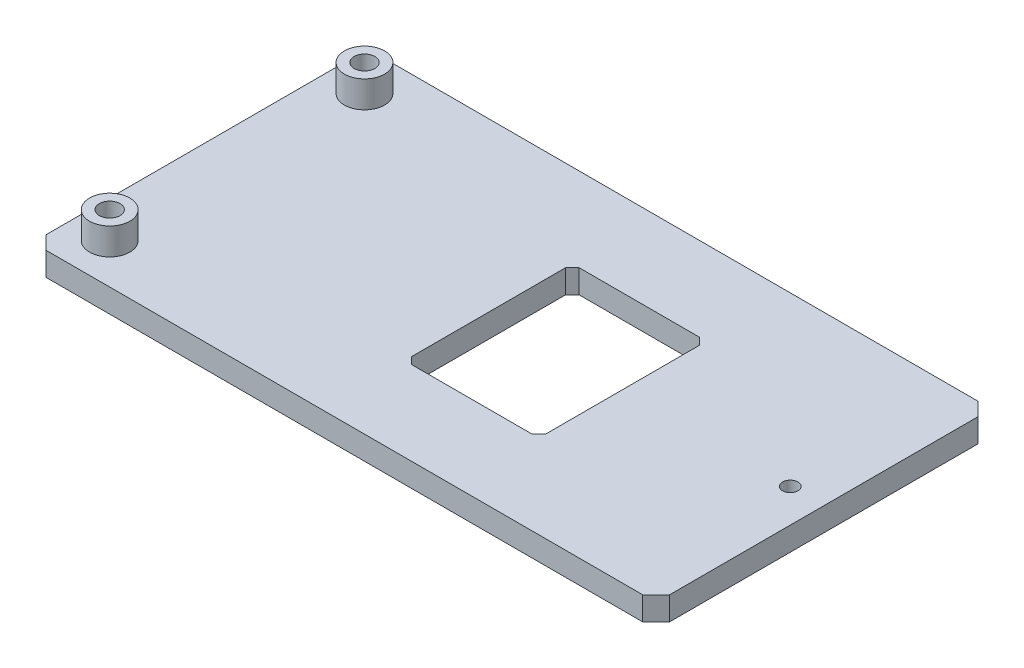
ISO-10303-21;
HEADER;
FILE_DESCRIPTION(('STEP AP214'),'2;1');
FILE_NAME('part.step','',(''),(''),'','','');
FILE_SCHEMA(('AUTOMOTIVE_DESIGN { 1 0 10303 214 1 1 1 1 }'));
ENDSEC;
DATA;
#1=APPLICATION_CONTEXT('core data for automotive mechanical design processes');
#2=APPLICATION_PROTOCOL_DEFINITION('international standard','automotive_design',2000,#1);
#3=PRODUCT_CONTEXT('',#1,'mechanical');
#4=PRODUCT('Part','Part','',(#3));
#5=PRODUCT_RELATED_PRODUCT_CATEGORY('part','',(#4));
#6=PRODUCT_DEFINITION_FORMATION('','',#4);
#7=PRODUCT_DEFINITION_CONTEXT('part definition',#1,'design');
#8=PRODUCT_DEFINITION('design','',#6,#7);
#9=PRODUCT_DEFINITION_SHAPE('','',#8);
#10=(LENGTH_UNIT() NAMED_UNIT(*) SI_UNIT(.MILLI.,.METRE.));
#11=(NAMED_UNIT(*) PLANE_ANGLE_UNIT() SI_UNIT($,.RADIAN.));
#12=(NAMED_UNIT(*) SI_UNIT($,.STERADIAN.) SOLID_ANGLE_UNIT());
#13=UNCERTAINTY_MEASURE_WITH_UNIT(LENGTH_MEASURE(1.E-05),#10,'distance_accuracy_value','');
#14=(GEOMETRIC_REPRESENTATION_CONTEXT(3) GLOBAL_UNCERTAINTY_ASSIGNED_CONTEXT((#13)) GLOBAL_UNIT_ASSIGNED_CONTEXT((#10,
#11,#12)) REPRESENTATION_CONTEXT('',''));
#15=CARTESIAN_POINT('',(0.,0.,0.));
#16=DIRECTION('',(0.,0.,1.));
#17=DIRECTION('',(1.,0.,0.));
#18=AXIS2_PLACEMENT_3D('',#15,#16,#17);
#19=CARTESIAN_POINT('',(0.,3.,0.));
#20=DIRECTION('',(0.,1.,0.));
#21=DIRECTION('',(0.,0.,1.));
#22=AXIS2_PLACEMENT_3D('',#19,#20,#21);
#23=PLANE('',#22);
#24=CARTESIAN_POINT('',(-45.1742624214534,3.,-19.));
#25=DIRECTION('',(0.,1.,0.));
#26=DIRECTION('',(0.,0.,1.));
#27=AXIS2_PLACEMENT_3D('',#24,#25,#26);
#28=CIRCLE('',#27,3.);
#29=CARTESIAN_POINT('',(-45.1742624214534,3.,-16.));
#30=VERTEX_POINT('',#29);
#31=EDGE_CURVE('E397',#30,#30,#28,.T.);
#32=ORIENTED_EDGE('',*,*,#31,.F.);
#33=EDGE_LOOP('',(#32));
#34=FACE_BOUND('',#33,.T.);
#35=DIRECTION('',(-0.707106781186546,0.,-0.707106781186549));
#36=VECTOR('',#35,1.);
#37=CARTESIAN_POINT('',(42.3257375785466,3.,-23.));
#38=LINE('',#37,#36);
#39=CARTESIAN_POINT('',(42.3257375785466,3.,-23.));
#40=VERTEX_POINT('',#39);
#41=CARTESIAN_POINT('',(40.3257375785466,3.,-25.));
#42=VERTEX_POINT('',#41);
#43=EDGE_CURVE('E194',#40,#42,#38,.T.);
#44=ORIENTED_EDGE('',*,*,#43,.T.);
#45=DIRECTION('',(-1.,0.,0.));
#46=VECTOR('',#45,1.);
#47=CARTESIAN_POINT('',(-48.6742624214534,3.,-25.));
#48=LINE('',#47,#46);
#49=CARTESIAN_POINT('',(-48.6742624214534,3.,-25.));
#50=VERTEX_POINT('',#49);
#51=EDGE_CURVE('E197',#42,#50,#48,.T.);
#52=ORIENTED_EDGE('',*,*,#51,.T.);
#53=DIRECTION('',(-0.707106781186547,0.,0.707106781186547));
#54=VECTOR('',#53,1.);
#55=CARTESIAN_POINT('',(-48.6742624214534,3.,-25.));
#56=LINE('',#55,#54);
#57=CARTESIAN_POINT('',(-50.6742624214534,3.,-23.));
#58=VERTEX_POINT('',#57);
#59=EDGE_CURVE('E200',#50,#58,#56,.T.);
#60=ORIENTED_EDGE('',*,*,#59,.T.);
#61=DIRECTION('',(0.,0.,1.));
#62=VECTOR('',#61,1.);
#63=CARTESIAN_POINT('',(-50.6742624214534,3.,-23.));
#64=LINE('',#63,#62);
#65=CARTESIAN_POINT('',(-50.6742624214534,3.,23.));
#66=VERTEX_POINT('',#65);
#67=EDGE_CURVE('E203',#58,#66,#64,.T.);
#68=ORIENTED_EDGE('',*,*,#67,.T.);
#69=DIRECTION('',(0.707106781186547,0.,0.707106781186547));
#70=VECTOR('',#69,1.);
#71=CARTESIAN_POINT('',(-50.6742624214534,3.,23.));
#72=LINE('',#71,#70);
#73=CARTESIAN_POINT('',(-48.6742624214534,3.,25.));
#74=VERTEX_POINT('',#73);
#75=EDGE_CURVE('E206',#66,#74,#72,.T.);
#76=ORIENTED_EDGE('',*,*,#75,.T.);
#77=DIRECTION('',(1.,0.,0.));
#78=VECTOR('',#77,1.);
#79=CARTESIAN_POINT('',(-48.6742624214534,3.,25.));
#80=LINE('',#79,#78);
#81=CARTESIAN_POINT('',(40.3257375785466,3.,25.));
#82=VERTEX_POINT('',#81);
#83=EDGE_CURVE('E209',#74,#82,#80,.T.);
#84=ORIENTED_EDGE('',*,*,#83,.T.);
#85=DIRECTION('',(0.707106781186546,0.,-0.707106781186549));
#86=VECTOR('',#85,1.);
#87=CARTESIAN_POINT('',(40.3257375785466,3.,25.));
#88=LINE('',#87,#86);
#89=CARTESIAN_POINT('',(42.3257375785466,3.,23.));
#90=VERTEX_POINT('',#89);
#91=EDGE_CURVE('E212',#82,#90,#88,.T.);
#92=ORIENTED_EDGE('',*,*,#91,.T.);
#93=DIRECTION('',(0.,0.,-1.));
#94=VECTOR('',#93,1.);
#95=CARTESIAN_POINT('',(42.3257375785466,3.,23.));
#96=LINE('',#95,#94);
#97=EDGE_CURVE('E215',#90,#40,#96,.T.);
#98=ORIENTED_EDGE('',*,*,#97,.T.);
#99=EDGE_LOOP('',(#44,#52,#60,#68,#76,#84,#92,#98));
#100=FACE_BOUND('',#99,.T.);
#101=CARTESIAN_POINT('',(37.3257375785466,3.,0.));
#102=DIRECTION('',(0.,1.,0.));
#103=DIRECTION('',(0.,0.,1.));
#104=AXIS2_PLACEMENT_3D('',#101,#102,#103);
#105=CIRCLE('',#104,1.15);
#106=CARTESIAN_POINT('',(37.3257375785466,3.,1.15));
#107=VERTEX_POINT('',#106);
#108=EDGE_CURVE('E191',#107,#107,#105,.T.);
#109=ORIENTED_EDGE('',*,*,#108,.F.);
#110=EDGE_LOOP('',(#109));
#111=FACE_BOUND('',#110,.T.);
#112=DIRECTION('',(-1.,0.,0.));
#113=VECTOR('',#112,1.);
#114=CARTESIAN_POINT('',(-6.67426242145343,3.,-12.5));
#115=LINE('',#114,#113);
#116=CARTESIAN_POINT('',(11.3257375785466,3.,-12.5));
#117=VERTEX_POINT('',#116);
#118=CARTESIAN_POINT('',(-6.67426242145343,3.,-12.5));
#119=VERTEX_POINT('',#118);
#120=EDGE_CURVE('E150',#117,#119,#115,.T.);
#121=ORIENTED_EDGE('',*,*,#120,.F.);
#122=DIRECTION('',(-0.707106781186547,0.,-0.707106781186547));
#123=VECTOR('',#122,1.);
#124=CARTESIAN_POINT('',(12.3257375785466,3.,-11.5));
#125=LINE('',#124,#123);
#126=CARTESIAN_POINT('',(12.3257375785466,3.,-11.5));
#127=VERTEX_POINT('',#126);
#128=EDGE_CURVE('E161',#127,#117,#125,.T.);
#129=ORIENTED_EDGE('',*,*,#128,.F.);
#130=DIRECTION('',(0.,0.,-1.));
#131=VECTOR('',#130,1.);
#132=CARTESIAN_POINT('',(12.3257375785466,3.,11.5));
#133=LINE('',#132,#131);
#134=CARTESIAN_POINT('',(12.3257375785466,3.,11.5));
#135=VERTEX_POINT('',#134);
#136=EDGE_CURVE('E189',#135,#127,#133,.T.);
#137=ORIENTED_EDGE('',*,*,#136,.F.);
#138=DIRECTION('',(0.707106781186547,0.,-0.707106781186547));
#139=VECTOR('',#138,1.);
#140=CARTESIAN_POINT('',(11.3257375785466,3.,12.5));
#141=LINE('',#140,#139);
#142=CARTESIAN_POINT('',(11.3257375785466,3.,12.5));
#143=VERTEX_POINT('',#142);
#144=EDGE_CURVE('E186',#143,#135,#141,.T.);
#145=ORIENTED_EDGE('',*,*,#144,.F.);
#146=DIRECTION('',(1.,0.,0.));
#147=VECTOR('',#146,1.);
#148=CARTESIAN_POINT('',(-6.67426242145343,3.,12.5));
#149=LINE('',#148,#147);
#150=CARTESIAN_POINT('',(-6.67426242145343,3.,12.5));
#151=VERTEX_POINT('',#150);
#152=EDGE_CURVE('E183',#151,#143,#149,.T.);
#153=ORIENTED_EDGE('',*,*,#152,.F.);
#154=DIRECTION('',(0.707106781186547,0.,0.707106781186548));
#155=VECTOR('',#154,1.);
#156=CARTESIAN_POINT('',(-6.67426242145343,3.,12.5));
#157=LINE('',#156,#155);
#158=CARTESIAN_POINT('',(-7.67426242145343,3.,11.5));
#159=VERTEX_POINT('',#158);
#160=EDGE_CURVE('E180',#159,#151,#157,.T.);
#161=ORIENTED_EDGE('',*,*,#160,.F.);
#162=DIRECTION('',(0.,0.,1.));
#163=VECTOR('',#162,1.);
#164=CARTESIAN_POINT('',(-7.67426242145343,3.,11.5));
#165=LINE('',#164,#163);
#166=CARTESIAN_POINT('',(-7.67426242145343,3.,-11.5));
#167=VERTEX_POINT('',#166);
#168=EDGE_CURVE('E174',#167,#159,#165,.T.);
#169=ORIENTED_EDGE('',*,*,#168,.F.);
#170=DIRECTION('',(-0.707106781186547,0.,0.707106781186548));
#171=VECTOR('',#170,1.);
#172=CARTESIAN_POINT('',(-7.67426242145343,3.,-11.5));
#173=LINE('',#172,#171);
#174=EDGE_CURVE('E172',#119,#167,#173,.T.);
#175=ORIENTED_EDGE('',*,*,#174,.F.);
#176=EDGE_LOOP('',(#121,#129,#137,#145,#153,#161,#169,#175));
#177=FACE_BOUND('',#176,.T.);
#178=CARTESIAN_POINT('',(-45.1742624214534,3.,19.));
#179=DIRECTION('',(0.,1.,0.));
#180=DIRECTION('',(0.,0.,-1.));
#181=AXIS2_PLACEMENT_3D('',#178,#179,#180);
#182=CIRCLE('',#181,3.);
#183=CARTESIAN_POINT('',(-45.1742624214534,3.,16.));
#184=VERTEX_POINT('',#183);
#185=EDGE_CURVE('E402',#184,#184,#182,.T.);
#186=ORIENTED_EDGE('',*,*,#185,.F.);
#187=EDGE_LOOP('',(#186));
#188=FACE_BOUND('',#187,.T.);
#189=ADVANCED_FACE('F32',(#34,#100,#111,#177,#188),#23,.T.);
#190=CARTESIAN_POINT('',(42.3257375785466,-0.506598951963253,-23.));
#191=DIRECTION('',(0.707106781186549,0.,-0.707106781186546));
#192=DIRECTION('',(-0.707106781186546,0.,-0.707106781186549));
#193=AXIS2_PLACEMENT_3D('',#190,#191,#192);
#194=PLANE('',#193);
#195=DIRECTION('',(0.,1.,0.));
#196=VECTOR('',#195,1.);
#197=CARTESIAN_POINT('',(40.3257375785466,-0.506598951963253,-25.));
#198=LINE('',#197,#196);
#199=CARTESIAN_POINT('',(40.3257375785466,-0.506598951963253,-25.));
#200=VERTEX_POINT('',#199);
#201=EDGE_CURVE('E36',#200,#42,#198,.T.);
#202=ORIENTED_EDGE('',*,*,#201,.T.);
#203=ORIENTED_EDGE('',*,*,#43,.F.);
#204=DIRECTION('',(0.,1.,0.));
#205=VECTOR('',#204,1.);
#206=CARTESIAN_POINT('',(42.3257375785466,-0.506598951963253,-23.));
#207=LINE('',#206,#205);
#208=CARTESIAN_POINT('',(42.3257375785466,-0.506598951963253,-23.));
#209=VERTEX_POINT('',#208);
#210=EDGE_CURVE('E11',#209,#40,#207,.T.);
#211=ORIENTED_EDGE('',*,*,#210,.F.);
#212=DIRECTION('',(-0.707106781186546,0.,-0.707106781186549));
#213=VECTOR('',#212,1.);
#214=CARTESIAN_POINT('',(42.3257375785466,-0.506598951963253,-23.));
#215=LINE('',#214,#213);
#216=EDGE_CURVE('E257',#209,#200,#215,.T.);
#217=ORIENTED_EDGE('',*,*,#216,.T.);
#218=EDGE_LOOP('',(#202,#203,#211,#217));
#219=FACE_BOUND('',#218,.T.);
#220=ADVANCED_FACE('F34',(#219),#194,.T.);
#221=CARTESIAN_POINT('',(42.3257375785466,-0.506598951963253,23.));
#222=DIRECTION('',(1.,0.,0.));
#223=DIRECTION('',(0.,0.,-1.));
#224=AXIS2_PLACEMENT_3D('',#221,#222,#223);
#225=PLANE('',#224);
#226=ORIENTED_EDGE('',*,*,#210,.T.);
#227=ORIENTED_EDGE('',*,*,#97,.F.);
#228=DIRECTION('',(0.,1.,0.));
#229=VECTOR('',#228,1.);
#230=CARTESIAN_POINT('',(42.3257375785466,-0.506598951963253,23.));
#231=LINE('',#230,#229);
#232=CARTESIAN_POINT('',(42.3257375785466,-0.506598951963253,23.));
#233=VERTEX_POINT('',#232);
#234=EDGE_CURVE('E41',#233,#90,#231,.T.);
#235=ORIENTED_EDGE('',*,*,#234,.F.);
#236=DIRECTION('',(0.,0.,-1.));
#237=VECTOR('',#236,1.);
#238=CARTESIAN_POINT('',(42.3257375785466,-0.506598951963253,23.));
#239=LINE('',#238,#237);
#240=EDGE_CURVE('E277',#233,#209,#239,.T.);
#241=ORIENTED_EDGE('',*,*,#240,.T.);
#242=EDGE_LOOP('',(#226,#227,#235,#241));
#243=FACE_BOUND('',#242,.T.);
#244=ADVANCED_FACE('F299',(#243),#225,.T.);
#245=CARTESIAN_POINT('',(40.3257375785466,-0.506598951963253,25.));
#246=DIRECTION('',(0.707106781186549,0.,0.707106781186546));
#247=DIRECTION('',(0.707106781186546,0.,-0.707106781186549));
#248=AXIS2_PLACEMENT_3D('',#245,#246,#247);
#249=PLANE('',#248);
#250=ORIENTED_EDGE('',*,*,#234,.T.);
#251=ORIENTED_EDGE('',*,*,#91,.F.);
#252=DIRECTION('',(0.,1.,0.));
#253=VECTOR('',#252,1.);
#254=CARTESIAN_POINT('',(40.3257375785466,-0.506598951963253,25.));
#255=LINE('',#254,#253);
#256=CARTESIAN_POINT('',(40.3257375785466,-0.506598951963253,25.));
#257=VERTEX_POINT('',#256);
#258=EDGE_CURVE('E281',#257,#82,#255,.T.);
#259=ORIENTED_EDGE('',*,*,#258,.F.);
#260=DIRECTION('',(0.707106781186546,0.,-0.707106781186549));
#261=VECTOR('',#260,1.);
#262=CARTESIAN_POINT('',(40.3257375785466,-0.506598951963253,25.));
#263=LINE('',#262,#261);
#264=EDGE_CURVE('E274',#257,#233,#263,.T.);
#265=ORIENTED_EDGE('',*,*,#264,.T.);
#266=EDGE_LOOP('',(#250,#251,#259,#265));
#267=FACE_BOUND('',#266,.T.);
#268=ADVANCED_FACE('F320',(#267),#249,.T.);
#269=CARTESIAN_POINT('',(-48.6742624214534,-0.506598951963253,25.));
#270=DIRECTION('',(0.,0.,1.));
#271=DIRECTION('',(1.,0.,0.));
#272=AXIS2_PLACEMENT_3D('',#269,#270,#271);
#273=PLANE('',#272);
#274=ORIENTED_EDGE('',*,*,#258,.T.);
#275=ORIENTED_EDGE('',*,*,#83,.F.);
#276=DIRECTION('',(0.,1.,0.));
#277=VECTOR('',#276,1.);
#278=CARTESIAN_POINT('',(-48.6742624214534,-0.506598951963253,25.));
#279=LINE('',#278,#277);
#280=CARTESIAN_POINT('',(-48.6742624214534,-0.506598951963253,25.));
#281=VERTEX_POINT('',#280);
#282=EDGE_CURVE('E283',#281,#74,#279,.T.);
#283=ORIENTED_EDGE('',*,*,#282,.F.);
#284=DIRECTION('',(1.,0.,0.));
#285=VECTOR('',#284,1.);
#286=CARTESIAN_POINT('',(-48.6742624214534,-0.506598951963253,25.));
#287=LINE('',#286,#285);
#288=EDGE_CURVE('E271',#281,#257,#287,.T.);
#289=ORIENTED_EDGE('',*,*,#288,.T.);
#290=EDGE_LOOP('',(#274,#275,#283,#289));
#291=FACE_BOUND('',#290,.T.);
#292=ADVANCED_FACE('F317',(#291),#273,.T.);
#293=CARTESIAN_POINT('',(-50.6742624214534,-0.506598951963253,23.));
#294=DIRECTION('',(-0.707106781186547,0.,0.707106781186547));
#295=DIRECTION('',(0.707106781186548,0.,0.707106781186548));
#296=AXIS2_PLACEMENT_3D('',#293,#294,#295);
#297=PLANE('',#296);
#298=ORIENTED_EDGE('',*,*,#282,.T.);
#299=ORIENTED_EDGE('',*,*,#75,.F.);
#300=DIRECTION('',(0.,1.,0.));
#301=VECTOR('',#300,1.);
#302=CARTESIAN_POINT('',(-50.6742624214534,-0.506598951963253,23.));
#303=LINE('',#302,#301);
#304=CARTESIAN_POINT('',(-50.6742624214534,-0.506598951963253,23.));
#305=VERTEX_POINT('',#304);
#306=EDGE_CURVE('E285',#305,#66,#303,.T.);
#307=ORIENTED_EDGE('',*,*,#306,.F.);
#308=DIRECTION('',(0.707106781186547,0.,0.707106781186547));
#309=VECTOR('',#308,1.);
#310=CARTESIAN_POINT('',(-50.6742624214534,-0.506598951963253,23.));
#311=LINE('',#310,#309);
#312=EDGE_CURVE('E268',#305,#281,#311,.T.);
#313=ORIENTED_EDGE('',*,*,#312,.T.);
#314=EDGE_LOOP('',(#298,#299,#307,#313));
#315=FACE_BOUND('',#314,.T.);
#316=ADVANCED_FACE('F315',(#315),#297,.T.);
#317=CARTESIAN_POINT('',(-50.6742624214534,-0.506598951963253,-23.));
#318=DIRECTION('',(-1.,0.,0.));
#319=DIRECTION('',(0.,0.,1.));
#320=AXIS2_PLACEMENT_3D('',#317,#318,#319);
#321=PLANE('',#320);
#322=ORIENTED_EDGE('',*,*,#306,.T.);
#323=ORIENTED_EDGE('',*,*,#67,.F.);
#324=DIRECTION('',(0.,1.,0.));
#325=VECTOR('',#324,1.);
#326=CARTESIAN_POINT('',(-50.6742624214534,-0.506598951963253,-23.));
#327=LINE('',#326,#325);
#328=CARTESIAN_POINT('',(-50.6742624214534,-0.506598951963253,-23.));
#329=VERTEX_POINT('',#328);
#330=EDGE_CURVE('E287',#329,#58,#327,.T.);
#331=ORIENTED_EDGE('',*,*,#330,.F.);
#332=DIRECTION('',(0.,0.,1.));
#333=VECTOR('',#332,1.);
#334=CARTESIAN_POINT('',(-50.6742624214534,-0.506598951963253,-23.));
#335=LINE('',#334,#333);
#336=EDGE_CURVE('E265',#329,#305,#335,.T.);
#337=ORIENTED_EDGE('',*,*,#336,.T.);
#338=EDGE_LOOP('',(#322,#323,#331,#337));
#339=FACE_BOUND('',#338,.T.);
#340=ADVANCED_FACE('F313',(#339),#321,.T.);
#341=CARTESIAN_POINT('',(-48.6742624214534,-0.506598951963253,-25.));
#342=DIRECTION('',(-0.707106781186547,0.,-0.707106781186547));
#343=DIRECTION('',(-0.707106781186548,0.,0.707106781186548));
#344=AXIS2_PLACEMENT_3D('',#341,#342,#343);
#345=PLANE('',#344);
#346=ORIENTED_EDGE('',*,*,#330,.T.);
#347=ORIENTED_EDGE('',*,*,#59,.F.);
#348=DIRECTION('',(0.,1.,0.));
#349=VECTOR('',#348,1.);
#350=CARTESIAN_POINT('',(-48.6742624214534,-0.506598951963253,-25.));
#351=LINE('',#350,#349);
#352=CARTESIAN_POINT('',(-48.6742624214534,-0.506598951963253,-25.));
#353=VERTEX_POINT('',#352);
#354=EDGE_CURVE('E288',#353,#50,#351,.T.);
#355=ORIENTED_EDGE('',*,*,#354,.F.);
#356=DIRECTION('',(-0.707106781186547,0.,0.707106781186547));
#357=VECTOR('',#356,1.);
#358=CARTESIAN_POINT('',(-48.6742624214534,-0.506598951963253,-25.));
#359=LINE('',#358,#357);
#360=EDGE_CURVE('E262',#353,#329,#359,.T.);
#361=ORIENTED_EDGE('',*,*,#360,.T.);
#362=EDGE_LOOP('',(#346,#347,#355,#361));
#363=FACE_BOUND('',#362,.T.);
#364=ADVANCED_FACE('F309',(#363),#345,.T.);
#365=CARTESIAN_POINT('',(-48.6742624214534,-0.506598951963253,-25.));
#366=DIRECTION('',(0.,0.,-1.));
#367=DIRECTION('',(-1.,0.,0.));
#368=AXIS2_PLACEMENT_3D('',#365,#366,#367);
#369=PLANE('',#368);
#370=ORIENTED_EDGE('',*,*,#354,.T.);
#371=ORIENTED_EDGE('',*,*,#51,.F.);
#372=ORIENTED_EDGE('',*,*,#201,.F.);
#373=DIRECTION('',(-1.,0.,0.));
#374=VECTOR('',#373,1.);
#375=CARTESIAN_POINT('',(-48.6742624214534,-0.506598951963253,-25.));
#376=LINE('',#375,#374);
#377=EDGE_CURVE('E259',#200,#353,#376,.T.);
#378=ORIENTED_EDGE('',*,*,#377,.T.);
#379=EDGE_LOOP('',(#370,#371,#372,#378));
#380=FACE_BOUND('',#379,.T.);
#381=ADVANCED_FACE('F292',(#380),#369,.T.);
#382=CARTESIAN_POINT('',(0.,-0.506598951963253,0.));
#383=DIRECTION('',(0.,1.,0.));
#384=DIRECTION('',(0.,0.,1.));
#385=AXIS2_PLACEMENT_3D('',#382,#383,#384);
#386=PLANE('',#385);
#387=DIRECTION('',(0.,0.,-1.));
#388=VECTOR('',#387,1.);
#389=CARTESIAN_POINT('',(12.3257375785466,-0.506598951963253,11.5));
#390=LINE('',#389,#388);
#391=CARTESIAN_POINT('',(12.3257375785466,-0.506598951963253,11.5));
#392=VERTEX_POINT('',#391);
#393=CARTESIAN_POINT('',(12.3257375785466,-0.506598951963253,-11.5));
#394=VERTEX_POINT('',#393);
#395=EDGE_CURVE('E158',#392,#394,#390,.T.);
#396=ORIENTED_EDGE('',*,*,#395,.T.);
#397=DIRECTION('',(-0.707106781186547,0.,-0.707106781186547));
#398=VECTOR('',#397,1.);
#399=CARTESIAN_POINT('',(12.3257375785466,-0.506598951963253,-11.5));
#400=LINE('',#399,#398);
#401=CARTESIAN_POINT('',(11.3257375785466,-0.506598951963253,-12.5));
#402=VERTEX_POINT('',#401);
#403=EDGE_CURVE('E218',#394,#402,#400,.T.);
#404=ORIENTED_EDGE('',*,*,#403,.T.);
#405=DIRECTION('',(-1.,0.,0.));
#406=VECTOR('',#405,1.);
#407=CARTESIAN_POINT('',(-6.67426242145343,-0.506598951963253,-12.5));
#408=LINE('',#407,#406);
#409=CARTESIAN_POINT('',(-6.67426242145343,-0.506598951963253,-12.5));
#410=VERTEX_POINT('',#409);
#411=EDGE_CURVE('E153',#402,#410,#408,.T.);
#412=ORIENTED_EDGE('',*,*,#411,.T.);
#413=DIRECTION('',(-0.707106781186547,0.,0.707106781186548));
#414=VECTOR('',#413,1.);
#415=CARTESIAN_POINT('',(-7.67426242145343,-0.506598951963253,-11.5));
#416=LINE('',#415,#414);
#417=CARTESIAN_POINT('',(-7.67426242145343,-0.506598951963253,-11.5));
#418=VERTEX_POINT('',#417);
#419=EDGE_CURVE('E49',#410,#418,#416,.T.);
#420=ORIENTED_EDGE('',*,*,#419,.T.);
#421=DIRECTION('',(0.,0.,1.));
#422=VECTOR('',#421,1.);
#423=CARTESIAN_POINT('',(-7.67426242145343,-0.506598951963253,11.5));
#424=LINE('',#423,#422);
#425=CARTESIAN_POINT('',(-7.67426242145343,-0.506598951963253,11.5));
#426=VERTEX_POINT('',#425);
#427=EDGE_CURVE('E222',#418,#426,#424,.T.);
#428=ORIENTED_EDGE('',*,*,#427,.T.);
#429=DIRECTION('',(0.707106781186547,0.,0.707106781186548));
#430=VECTOR('',#429,1.);
#431=CARTESIAN_POINT('',(-6.67426242145343,-0.506598951963253,12.5));
#432=LINE('',#431,#430);
#433=CARTESIAN_POINT('',(-6.67426242145343,-0.506598951963253,12.5));
#434=VERTEX_POINT('',#433);
#435=EDGE_CURVE('E225',#426,#434,#432,.T.);
#436=ORIENTED_EDGE('',*,*,#435,.T.);
#437=DIRECTION('',(1.,0.,0.));
#438=VECTOR('',#437,1.);
#439=CARTESIAN_POINT('',(-6.67426242145343,-0.506598951963253,12.5));
#440=LINE('',#439,#438);
#441=CARTESIAN_POINT('',(11.3257375785466,-0.506598951963253,12.5));
#442=VERTEX_POINT('',#441);
#443=EDGE_CURVE('E228',#434,#442,#440,.T.);
#444=ORIENTED_EDGE('',*,*,#443,.T.);
#445=DIRECTION('',(0.707106781186547,0.,-0.707106781186547));
#446=VECTOR('',#445,1.);
#447=CARTESIAN_POINT('',(11.3257375785466,-0.506598951963253,12.5));
#448=LINE('',#447,#446);
#449=EDGE_CURVE('E231',#442,#392,#448,.T.);
#450=ORIENTED_EDGE('',*,*,#449,.T.);
#451=EDGE_LOOP('',(#396,#404,#412,#420,#428,#436,#444,#450));
#452=FACE_BOUND('',#451,.T.);
#453=CARTESIAN_POINT('',(37.3257375785466,-0.506598951963253,0.));
#454=DIRECTION('',(0.,1.,0.));
#455=DIRECTION('',(0.,0.,1.));
#456=AXIS2_PLACEMENT_3D('',#453,#454,#455);
#457=CIRCLE('',#456,1.15);
#458=CARTESIAN_POINT('',(37.3257375785466,-0.506598951963253,1.15));
#459=VERTEX_POINT('',#458);
#460=EDGE_CURVE('E237',#459,#459,#457,.T.);
#461=ORIENTED_EDGE('',*,*,#460,.T.);
#462=EDGE_LOOP('',(#461));
#463=FACE_BOUND('',#462,.T.);
#464=CARTESIAN_POINT('',(-45.1742624214534,-0.506598951963253,19.));
#465=DIRECTION('',(0.,1.,0.));
#466=DIRECTION('',(0.,0.,-1.));
#467=AXIS2_PLACEMENT_3D('',#464,#465,#466);
#468=CIRCLE('',#467,1.55);
#469=CARTESIAN_POINT('',(-45.1742624214534,-0.506598951963253,17.45));
#470=VERTEX_POINT('',#469);
#471=EDGE_CURVE('E251',#470,#470,#468,.T.);
#472=ORIENTED_EDGE('',*,*,#471,.T.);
#473=EDGE_LOOP('',(#472));
#474=FACE_BOUND('',#473,.T.);
#475=CARTESIAN_POINT('',(-45.1742624214534,-0.506598951963253,-19.));
#476=DIRECTION('',(0.,1.,0.));
#477=DIRECTION('',(0.,0.,1.));
#478=AXIS2_PLACEMENT_3D('',#475,#476,#477);
#479=CIRCLE('',#478,1.55);
#480=CARTESIAN_POINT('',(-45.1742624214534,-0.506598951963253,-17.45));
#481=VERTEX_POINT('',#480);
#482=EDGE_CURVE('E254',#481,#481,#479,.T.);
#483=ORIENTED_EDGE('',*,*,#482,.T.);
#484=EDGE_LOOP('',(#483));
#485=FACE_BOUND('',#484,.T.);
#486=ORIENTED_EDGE('',*,*,#216,.F.);
#487=ORIENTED_EDGE('',*,*,#240,.F.);
#488=ORIENTED_EDGE('',*,*,#264,.F.);
#489=ORIENTED_EDGE('',*,*,#288,.F.);
#490=ORIENTED_EDGE('',*,*,#312,.F.);
#491=ORIENTED_EDGE('',*,*,#336,.F.);
#492=ORIENTED_EDGE('',*,*,#360,.F.);
#493=ORIENTED_EDGE('',*,*,#377,.F.);
#494=EDGE_LOOP('',(#486,#487,#488,#489,#490,#491,#492,#493));
#495=FACE_BOUND('',#494,.T.);
#496=ADVANCED_FACE('F303',(#452,#463,#474,#485,#495),#386,.F.);
#497=CARTESIAN_POINT('',(-45.1742624214534,-0.506598951963253,-19.));
#498=DIRECTION('',(0.,1.,0.));
#499=DIRECTION('',(0.,0.,1.));
#500=AXIS2_PLACEMENT_3D('',#497,#498,#499);
#501=CYLINDRICAL_SURFACE('',#500,1.55);
#502=ORIENTED_EDGE('',*,*,#482,.F.);
#503=EDGE_LOOP('',(#502));
#504=FACE_BOUND('',#503,.T.);
#505=CARTESIAN_POINT('',(-45.1742624214534,7.,-19.));
#506=DIRECTION('',(0.,1.,0.));
#507=DIRECTION('',(0.,0.,1.));
#508=AXIS2_PLACEMENT_3D('',#505,#506,#507);
#509=CIRCLE('',#508,1.55);
#510=CARTESIAN_POINT('',(-45.1742624214534,7.,-17.45));
#511=VERTEX_POINT('',#510);
#512=EDGE_CURVE('E395',#511,#511,#509,.T.);
#513=ORIENTED_EDGE('',*,*,#512,.T.);
#514=EDGE_LOOP('',(#513));
#515=FACE_BOUND('',#514,.T.);
#516=ADVANCED_FACE('F375',(#504,#515),#501,.F.);
#517=CARTESIAN_POINT('',(-45.1742624214534,-0.506598951963253,19.));
#518=DIRECTION('',(0.,1.,0.));
#519=DIRECTION('',(0.,0.,1.));
#520=AXIS2_PLACEMENT_3D('',#517,#518,#519);
#521=CYLINDRICAL_SURFACE('',#520,1.55);
#522=ORIENTED_EDGE('',*,*,#471,.F.);
#523=EDGE_LOOP('',(#522));
#524=FACE_BOUND('',#523,.T.);
#525=CARTESIAN_POINT('',(-45.1742624214534,7.,19.));
#526=DIRECTION('',(0.,1.,0.));
#527=DIRECTION('',(0.,0.,-1.));
#528=AXIS2_PLACEMENT_3D('',#525,#526,#527);
#529=CIRCLE('',#528,1.55);
#530=CARTESIAN_POINT('',(-45.1742624214534,7.,17.45));
#531=VERTEX_POINT('',#530);
#532=EDGE_CURVE('E431',#531,#531,#529,.T.);
#533=ORIENTED_EDGE('',*,*,#532,.T.);
#534=EDGE_LOOP('',(#533));
#535=FACE_BOUND('',#534,.T.);
#536=ADVANCED_FACE('F371',(#524,#535),#521,.F.);
#537=CARTESIAN_POINT('',(37.3257375785466,-0.506598951963253,0.));
#538=DIRECTION('',(0.,1.,0.));
#539=DIRECTION('',(0.,0.,1.));
#540=AXIS2_PLACEMENT_3D('',#537,#538,#539);
#541=CYLINDRICAL_SURFACE('',#540,1.15);
#542=ORIENTED_EDGE('',*,*,#460,.F.);
#543=EDGE_LOOP('',(#542));
#544=FACE_BOUND('',#543,.T.);
#545=ORIENTED_EDGE('',*,*,#108,.T.);
#546=EDGE_LOOP('',(#545));
#547=FACE_BOUND('',#546,.T.);
#548=ADVANCED_FACE('F368',(#544,#547),#541,.F.);
#549=CARTESIAN_POINT('',(12.3257375785466,-0.506598951963253,-11.5));
#550=DIRECTION('',(0.707106781186547,0.,-0.707106781186547));
#551=DIRECTION('',(-0.707106781186548,0.,-0.707106781186548));
#552=AXIS2_PLACEMENT_3D('',#549,#550,#551);
#553=PLANE('',#552);
#554=DIRECTION('',(0.,1.,0.));
#555=VECTOR('',#554,1.);
#556=CARTESIAN_POINT('',(12.3257375785466,-0.506598951963253,-11.5));
#557=LINE('',#556,#555);
#558=EDGE_CURVE('E163',#394,#127,#557,.T.);
#559=ORIENTED_EDGE('',*,*,#558,.T.);
#560=ORIENTED_EDGE('',*,*,#128,.T.);
#561=DIRECTION('',(0.,1.,0.));
#562=VECTOR('',#561,1.);
#563=CARTESIAN_POINT('',(11.3257375785466,-0.506598951963253,-12.5));
#564=LINE('',#563,#562);
#565=EDGE_CURVE('E146',#402,#117,#564,.T.);
#566=ORIENTED_EDGE('',*,*,#565,.F.);
#567=ORIENTED_EDGE('',*,*,#403,.F.);
#568=EDGE_LOOP('',(#559,#560,#566,#567));
#569=FACE_BOUND('',#568,.T.);
#570=ADVANCED_FACE('F162',(#569),#553,.F.);
#571=CARTESIAN_POINT('',(12.3257375785466,-0.506598951963253,11.5));
#572=DIRECTION('',(1.,0.,0.));
#573=DIRECTION('',(0.,0.,-1.));
#574=AXIS2_PLACEMENT_3D('',#571,#572,#573);
#575=PLANE('',#574);
#576=DIRECTION('',(0.,1.,0.));
#577=VECTOR('',#576,1.);
#578=CARTESIAN_POINT('',(12.3257375785466,-0.506598951963253,11.5));
#579=LINE('',#578,#577);
#580=EDGE_CURVE('E238',#392,#135,#579,.T.);
#581=ORIENTED_EDGE('',*,*,#580,.T.);
#582=ORIENTED_EDGE('',*,*,#136,.T.);
#583=ORIENTED_EDGE('',*,*,#558,.F.);
#584=ORIENTED_EDGE('',*,*,#395,.F.);
#585=EDGE_LOOP('',(#581,#582,#583,#584));
#586=FACE_BOUND('',#585,.T.);
#587=ADVANCED_FACE('F340',(#586),#575,.F.);
#588=CARTESIAN_POINT('',(11.3257375785466,-0.506598951963253,12.5));
#589=DIRECTION('',(0.707106781186547,0.,0.707106781186547));
#590=DIRECTION('',(0.707106781186548,0.,-0.707106781186548));
#591=AXIS2_PLACEMENT_3D('',#588,#589,#590);
#592=PLANE('',#591);
#593=DIRECTION('',(0.,1.,0.));
#594=VECTOR('',#593,1.);
#595=CARTESIAN_POINT('',(11.3257375785466,-0.506598951963253,12.5));
#596=LINE('',#595,#594);
#597=EDGE_CURVE('E240',#442,#143,#596,.T.);
#598=ORIENTED_EDGE('',*,*,#597,.T.);
#599=ORIENTED_EDGE('',*,*,#144,.T.);
#600=ORIENTED_EDGE('',*,*,#580,.F.);
#601=ORIENTED_EDGE('',*,*,#449,.F.);
#602=EDGE_LOOP('',(#598,#599,#600,#601));
#603=FACE_BOUND('',#602,.T.);
#604=ADVANCED_FACE('F343',(#603),#592,.F.);
#605=CARTESIAN_POINT('',(-6.67426242145343,-0.506598951963253,12.5));
#606=DIRECTION('',(0.,0.,1.));
#607=DIRECTION('',(1.,0.,0.));
#608=AXIS2_PLACEMENT_3D('',#605,#606,#607);
#609=PLANE('',#608);
#610=DIRECTION('',(0.,1.,0.));
#611=VECTOR('',#610,1.);
#612=CARTESIAN_POINT('',(-6.67426242145343,-0.506598951963253,12.5));
#613=LINE('',#612,#611);
#614=EDGE_CURVE('E242',#434,#151,#613,.T.);
#615=ORIENTED_EDGE('',*,*,#614,.T.);
#616=ORIENTED_EDGE('',*,*,#152,.T.);
#617=ORIENTED_EDGE('',*,*,#597,.F.);
#618=ORIENTED_EDGE('',*,*,#443,.F.);
#619=EDGE_LOOP('',(#615,#616,#617,#618));
#620=FACE_BOUND('',#619,.T.);
#621=ADVANCED_FACE('F347',(#620),#609,.F.);
#622=CARTESIAN_POINT('',(-6.67426242145343,-0.506598951963253,12.5));
#623=DIRECTION('',(-0.707106781186548,0.,0.707106781186547));
#624=DIRECTION('',(0.707106781186547,0.,0.707106781186548));
#625=AXIS2_PLACEMENT_3D('',#622,#623,#624);
#626=PLANE('',#625);
#627=DIRECTION('',(0.,1.,0.));
#628=VECTOR('',#627,1.);
#629=CARTESIAN_POINT('',(-7.67426242145343,-0.506598951963253,11.5));
#630=LINE('',#629,#628);
#631=EDGE_CURVE('E244',#426,#159,#630,.T.);
#632=ORIENTED_EDGE('',*,*,#631,.T.);
#633=ORIENTED_EDGE('',*,*,#160,.T.);
#634=ORIENTED_EDGE('',*,*,#614,.F.);
#635=ORIENTED_EDGE('',*,*,#435,.F.);
#636=EDGE_LOOP('',(#632,#633,#634,#635));
#637=FACE_BOUND('',#636,.T.);
#638=ADVANCED_FACE('F351',(#637),#626,.F.);
#639=CARTESIAN_POINT('',(-7.67426242145343,-0.506598951963253,11.5));
#640=DIRECTION('',(-1.,0.,0.));
#641=DIRECTION('',(0.,0.,1.));
#642=AXIS2_PLACEMENT_3D('',#639,#640,#641);
#643=PLANE('',#642);
#644=DIRECTION('',(0.,1.,0.));
#645=VECTOR('',#644,1.);
#646=CARTESIAN_POINT('',(-7.67426242145343,-0.506598951963253,-11.5));
#647=LINE('',#646,#645);
#648=EDGE_CURVE('E246',#418,#167,#647,.T.);
#649=ORIENTED_EDGE('',*,*,#648,.T.);
#650=ORIENTED_EDGE('',*,*,#168,.T.);
#651=ORIENTED_EDGE('',*,*,#631,.F.);
#652=ORIENTED_EDGE('',*,*,#427,.F.);
#653=EDGE_LOOP('',(#649,#650,#651,#652));
#654=FACE_BOUND('',#653,.T.);
#655=ADVANCED_FACE('F355',(#654),#643,.F.);
#656=CARTESIAN_POINT('',(-7.67426242145343,-0.506598951963253,-11.5));
#657=DIRECTION('',(-0.707106781186548,0.,-0.707106781186547));
#658=DIRECTION('',(-0.707106781186547,0.,0.707106781186548));
#659=AXIS2_PLACEMENT_3D('',#656,#657,#658);
#660=PLANE('',#659);
#661=DIRECTION('',(0.,1.,0.));
#662=VECTOR('',#661,1.);
#663=CARTESIAN_POINT('',(-6.67426242145343,-0.506598951963253,-12.5));
#664=LINE('',#663,#662);
#665=EDGE_CURVE('E157',#410,#119,#664,.T.);
#666=ORIENTED_EDGE('',*,*,#665,.T.);
#667=ORIENTED_EDGE('',*,*,#174,.T.);
#668=ORIENTED_EDGE('',*,*,#648,.F.);
#669=ORIENTED_EDGE('',*,*,#419,.F.);
#670=EDGE_LOOP('',(#666,#667,#668,#669));
#671=FACE_BOUND('',#670,.T.);
#672=ADVANCED_FACE('F359',(#671),#660,.F.);
#673=CARTESIAN_POINT('',(-6.67426242145343,-0.506598951963253,-12.5));
#674=DIRECTION('',(0.,0.,-1.));
#675=DIRECTION('',(-1.,0.,0.));
#676=AXIS2_PLACEMENT_3D('',#673,#674,#675);
#677=PLANE('',#676);
#678=ORIENTED_EDGE('',*,*,#565,.T.);
#679=ORIENTED_EDGE('',*,*,#120,.T.);
#680=ORIENTED_EDGE('',*,*,#665,.F.);
#681=ORIENTED_EDGE('',*,*,#411,.F.);
#682=EDGE_LOOP('',(#678,#679,#680,#681));
#683=FACE_BOUND('',#682,.T.);
#684=ADVANCED_FACE('F148',(#683),#677,.F.);
#685=CARTESIAN_POINT('',(-45.1742624214534,7.,-19.));
#686=DIRECTION('',(0.,1.,0.));
#687=DIRECTION('',(0.,0.,1.));
#688=AXIS2_PLACEMENT_3D('',#685,#686,#687);
#689=PLANE('',#688);
#690=CARTESIAN_POINT('',(-45.1742624214534,7.,-19.));
#691=DIRECTION('',(0.,1.,0.));
#692=DIRECTION('',(0.,0.,1.));
#693=AXIS2_PLACEMENT_3D('',#690,#691,#692);
#694=CIRCLE('',#693,3.);
#695=CARTESIAN_POINT('',(-45.1742624214534,7.,-16.));
#696=VERTEX_POINT('',#695);
#697=EDGE_CURVE('E167',#696,#696,#694,.T.);
#698=ORIENTED_EDGE('',*,*,#697,.T.);
#699=EDGE_LOOP('',(#698));
#700=FACE_BOUND('',#699,.T.);
#701=ORIENTED_EDGE('',*,*,#512,.F.);
#702=EDGE_LOOP('',(#701));
#703=FACE_BOUND('',#702,.T.);
#704=ADVANCED_FACE('F365',(#700,#703),#689,.T.);
#705=CARTESIAN_POINT('',(-45.1742624214534,7.,-19.));
#706=DIRECTION('',(0.,-1.,0.));
#707=DIRECTION('',(0.,0.,-1.));
#708=AXIS2_PLACEMENT_3D('',#705,#706,#707);
#709=CYLINDRICAL_SURFACE('',#708,3.);
#710=ORIENTED_EDGE('',*,*,#697,.F.);
#711=EDGE_LOOP('',(#710));
#712=FACE_BOUND('',#711,.T.);
#713=ORIENTED_EDGE('',*,*,#31,.T.);
#714=EDGE_LOOP('',(#713));
#715=FACE_BOUND('',#714,.T.);
#716=ADVANCED_FACE('F338',(#712,#715),#709,.T.);
#717=CARTESIAN_POINT('',(-45.1742624214534,7.,19.));
#718=DIRECTION('',(0.,-1.,0.));
#719=DIRECTION('',(0.,0.,-1.));
#720=AXIS2_PLACEMENT_3D('',#717,#718,#719);
#721=PLANE('',#720);
#722=CARTESIAN_POINT('',(-45.1742624214534,7.,19.));
#723=DIRECTION('',(0.,1.,0.));
#724=DIRECTION('',(0.,0.,-1.));
#725=AXIS2_PLACEMENT_3D('',#722,#723,#724);
#726=CIRCLE('',#725,3.);
#727=CARTESIAN_POINT('',(-45.1742624214534,7.,16.));
#728=VERTEX_POINT('',#727);
#729=EDGE_CURVE('E398',#728,#728,#726,.T.);
#730=ORIENTED_EDGE('',*,*,#729,.T.);
#731=EDGE_LOOP('',(#730));
#732=FACE_BOUND('',#731,.T.);
#733=ORIENTED_EDGE('',*,*,#532,.F.);
#734=EDGE_LOOP('',(#733));
#735=FACE_BOUND('',#734,.T.);
#736=ADVANCED_FACE('F412',(#732,#735),#721,.F.);
#737=CARTESIAN_POINT('',(-45.1742624214534,7.,19.));
#738=DIRECTION('',(0.,-1.,0.));
#739=DIRECTION('',(0.,0.,-1.));
#740=AXIS2_PLACEMENT_3D('',#737,#738,#739);
#741=CYLINDRICAL_SURFACE('',#740,3.);
#742=ORIENTED_EDGE('',*,*,#729,.F.);
#743=EDGE_LOOP('',(#742));
#744=FACE_BOUND('',#743,.T.);
#745=ORIENTED_EDGE('',*,*,#185,.T.);
#746=EDGE_LOOP('',(#745));
#747=FACE_BOUND('',#746,.T.);
#748=ADVANCED_FACE('F417',(#744,#747),#741,.T.);
#749=CLOSED_SHELL('',(#189,#220,#244,#268,#292,#316,#340,#364,#381,#496,#516,#536,#548,#570,
#587,#604,#621,#638,#655,#672,#684,#704,#716,#736,#748));
#750=MANIFOLD_SOLID_BREP('B2',#749);
#751=ADVANCED_BREP_SHAPE_REPRESENTATION('',(#18,#750),#14);
#752=SHAPE_DEFINITION_REPRESENTATION(#9,#751);
ENDSEC;
END-ISO-10303-21;
